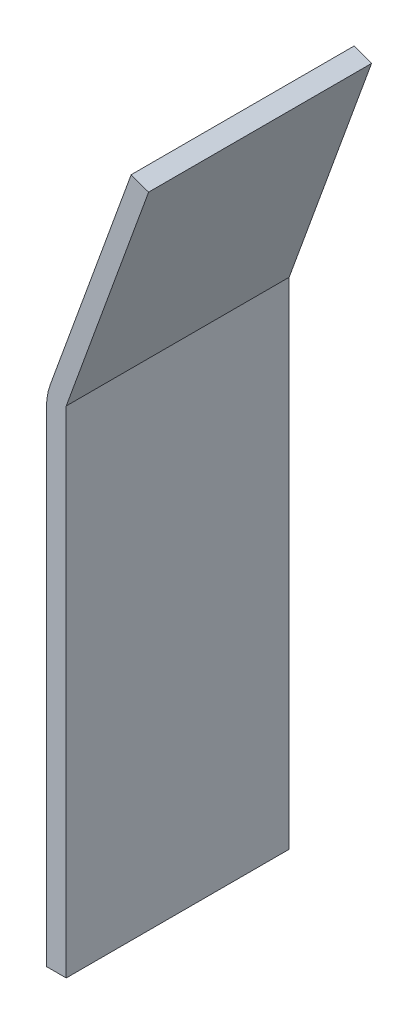
ISO-10303-21;
HEADER;
FILE_DESCRIPTION(('STEP AP214'),'2;1');
FILE_NAME('part.step','',(''),(''),'','','');
FILE_SCHEMA(('AUTOMOTIVE_DESIGN { 1 0 10303 214 1 1 1 1 }'));
ENDSEC;
DATA;
#1=APPLICATION_CONTEXT('core data for automotive mechanical design processes');
#2=APPLICATION_PROTOCOL_DEFINITION('international standard','automotive_design',2000,#1);
#3=PRODUCT_CONTEXT('',#1,'mechanical');
#4=PRODUCT('Part','Part','',(#3));
#5=PRODUCT_RELATED_PRODUCT_CATEGORY('part','',(#4));
#6=PRODUCT_DEFINITION_FORMATION('','',#4);
#7=PRODUCT_DEFINITION_CONTEXT('part definition',#1,'design');
#8=PRODUCT_DEFINITION('design','',#6,#7);
#9=PRODUCT_DEFINITION_SHAPE('','',#8);
#10=(LENGTH_UNIT() NAMED_UNIT(*) SI_UNIT(.MILLI.,.METRE.));
#11=(NAMED_UNIT(*) PLANE_ANGLE_UNIT() SI_UNIT($,.RADIAN.));
#12=(NAMED_UNIT(*) SI_UNIT($,.STERADIAN.) SOLID_ANGLE_UNIT());
#13=UNCERTAINTY_MEASURE_WITH_UNIT(LENGTH_MEASURE(1.E-05),#10,'distance_accuracy_value','');
#14=(GEOMETRIC_REPRESENTATION_CONTEXT(3) GLOBAL_UNCERTAINTY_ASSIGNED_CONTEXT((#13)) GLOBAL_UNIT_ASSIGNED_CONTEXT((#10,
#11,#12)) REPRESENTATION_CONTEXT('',''));
#15=CARTESIAN_POINT('',(0.,0.,0.));
#16=DIRECTION('',(0.,0.,1.));
#17=DIRECTION('',(1.,0.,0.));
#18=AXIS2_PLACEMENT_3D('',#15,#16,#17);
#19=CARTESIAN_POINT('',(3.19253331742775,0.,-18.));
#20=DIRECTION('',(0.,-1.,0.));
#21=DIRECTION('',(1.,0.,0.));
#22=AXIS2_PLACEMENT_3D('',#19,#20,#21);
#23=PLANE('',#22);
#24=DIRECTION('',(0.,0.,1.));
#25=VECTOR('',#24,1.);
#26=CARTESIAN_POINT('',(3.19253331742775,0.,-18.));
#27=LINE('',#26,#25);
#28=CARTESIAN_POINT('',(3.19253331742775,0.,-18.));
#29=VERTEX_POINT('',#28);
#30=CARTESIAN_POINT('',(3.19253331742775,0.,18.));
#31=VERTEX_POINT('',#30);
#32=EDGE_CURVE('E94',#29,#31,#27,.T.);
#33=ORIENTED_EDGE('',*,*,#32,.T.);
#34=DIRECTION('',(1.,0.,0.));
#35=VECTOR('',#34,1.);
#36=CARTESIAN_POINT('',(3.19253331742775,0.,18.));
#37=LINE('',#36,#35);
#38=CARTESIAN_POINT('',(0.,0.,18.));
#39=VERTEX_POINT('',#38);
#40=EDGE_CURVE('E98',#39,#31,#37,.T.);
#41=ORIENTED_EDGE('',*,*,#40,.F.);
#42=DIRECTION('',(0.,0.,1.));
#43=VECTOR('',#42,1.);
#44=CARTESIAN_POINT('',(0.,0.,-18.));
#45=LINE('',#44,#43);
#46=CARTESIAN_POINT('',(0.,0.,-18.));
#47=VERTEX_POINT('',#46);
#48=EDGE_CURVE('E139',#47,#39,#45,.T.);
#49=ORIENTED_EDGE('',*,*,#48,.F.);
#50=DIRECTION('',(1.,0.,0.));
#51=VECTOR('',#50,1.);
#52=CARTESIAN_POINT('',(3.19253331742775,0.,-18.));
#53=LINE('',#52,#51);
#54=EDGE_CURVE('E100',#47,#29,#53,.T.);
#55=ORIENTED_EDGE('',*,*,#54,.T.);
#56=EDGE_LOOP('',(#33,#41,#49,#55));
#57=FACE_BOUND('',#56,.T.);
#58=ADVANCED_FACE('F37',(#57),#23,.T.);
#59=CARTESIAN_POINT('',(0.,0.,-18.));
#60=DIRECTION('',(-1.,0.,0.));
#61=DIRECTION('',(0.,0.,1.));
#62=AXIS2_PLACEMENT_3D('',#59,#60,#61);
#63=PLANE('',#62);
#64=DIRECTION('',(0.,-1.,0.));
#65=VECTOR('',#64,1.);
#66=CARTESIAN_POINT('',(0.,0.,18.));
#67=LINE('',#66,#65);
#68=CARTESIAN_POINT('',(0.,78.2367301929154,18.));
#69=VERTEX_POINT('',#68);
#70=EDGE_CURVE('E115',#69,#39,#67,.T.);
#71=ORIENTED_EDGE('',*,*,#70,.F.);
#72=DIRECTION('',(0.,0.,1.));
#73=VECTOR('',#72,1.);
#74=CARTESIAN_POINT('',(0.,78.2367301929154,-18.));
#75=LINE('',#74,#73);
#76=CARTESIAN_POINT('',(0.,78.2367301929154,-18.));
#77=VERTEX_POINT('',#76);
#78=EDGE_CURVE('E45',#69,#77,#75,.F.);
#79=ORIENTED_EDGE('',*,*,#78,.T.);
#80=DIRECTION('',(0.,-1.,0.));
#81=VECTOR('',#80,1.);
#82=CARTESIAN_POINT('',(0.,0.,-18.));
#83=LINE('',#82,#81);
#84=EDGE_CURVE('E105',#77,#47,#83,.T.);
#85=ORIENTED_EDGE('',*,*,#84,.T.);
#86=ORIENTED_EDGE('',*,*,#48,.T.);
#87=EDGE_LOOP('',(#71,#79,#85,#86));
#88=FACE_BOUND('',#87,.T.);
#89=ADVANCED_FACE('F169',(#88),#63,.T.);
#90=CARTESIAN_POINT('',(0.,80.,-18.));
#91=DIRECTION('',(-0.939692620785909,0.342020143325666,0.));
#92=DIRECTION('',(-0.342020143325666,-0.939692620785909,0.));
#93=AXIS2_PLACEMENT_3D('',#90,#91,#92);
#94=PLANE('',#93);
#95=DIRECTION('',(-0.342020143325666,-0.939692620785909,0.));
#96=VECTOR('',#95,1.);
#97=CARTESIAN_POINT('',(0.,80.,-18.));
#98=LINE('',#97,#96);
#99=CARTESIAN_POINT('',(13.6808057330267,117.587704831436,-18.));
#100=VERTEX_POINT('',#99);
#101=CARTESIAN_POINT('',(0.603073792140909,81.656931626172,-18.));
#102=VERTEX_POINT('',#101);
#103=EDGE_CURVE('E135',#100,#102,#98,.T.);
#104=ORIENTED_EDGE('',*,*,#103,.T.);
#105=DIRECTION('',(0.,0.,1.));
#106=VECTOR('',#105,1.);
#107=CARTESIAN_POINT('',(0.603073792140909,81.656931626172,-18.));
#108=LINE('',#107,#106);
#109=CARTESIAN_POINT('',(0.603073792140909,81.656931626172,18.));
#110=VERTEX_POINT('',#109);
#111=EDGE_CURVE('E141',#102,#110,#108,.T.);
#112=ORIENTED_EDGE('',*,*,#111,.T.);
#113=DIRECTION('',(-0.342020143325666,-0.939692620785909,0.));
#114=VECTOR('',#113,1.);
#115=CARTESIAN_POINT('',(0.,80.,18.));
#116=LINE('',#115,#114);
#117=CARTESIAN_POINT('',(13.6808057330267,117.587704831436,18.));
#118=VERTEX_POINT('',#117);
#119=EDGE_CURVE('E123',#118,#110,#116,.T.);
#120=ORIENTED_EDGE('',*,*,#119,.F.);
#121=DIRECTION('',(0.,0.,1.));
#122=VECTOR('',#121,1.);
#123=CARTESIAN_POINT('',(13.6808057330267,117.587704831436,-18.));
#124=LINE('',#123,#122);
#125=EDGE_CURVE('E142',#100,#118,#124,.T.);
#126=ORIENTED_EDGE('',*,*,#125,.F.);
#127=EDGE_LOOP('',(#104,#112,#120,#126));
#128=FACE_BOUND('',#127,.T.);
#129=ADVANCED_FACE('F152',(#128),#94,.T.);
#130=CARTESIAN_POINT('',(13.6808057330267,117.587704831436,-18.));
#131=DIRECTION('',(0.342020143325668,0.939692620785909,0.));
#132=DIRECTION('',(-0.939692620785909,0.342020143325668,0.));
#133=AXIS2_PLACEMENT_3D('',#130,#131,#132);
#134=PLANE('',#133);
#135=ORIENTED_EDGE('',*,*,#125,.T.);
#136=DIRECTION('',(-0.939692620785909,0.342020143325668,0.));
#137=VECTOR('',#136,1.);
#138=CARTESIAN_POINT('',(13.6808057330267,117.587704831436,18.));
#139=LINE('',#138,#137);
#140=CARTESIAN_POINT('',(16.4998835953844,116.561644401459,18.));
#141=VERTEX_POINT('',#140);
#142=EDGE_CURVE('E120',#141,#118,#139,.T.);
#143=ORIENTED_EDGE('',*,*,#142,.F.);
#144=DIRECTION('',(0.,0.,1.));
#145=VECTOR('',#144,1.);
#146=CARTESIAN_POINT('',(16.4998835953844,116.561644401459,-18.));
#147=LINE('',#146,#145);
#148=CARTESIAN_POINT('',(16.4998835953844,116.561644401459,-18.));
#149=VERTEX_POINT('',#148);
#150=EDGE_CURVE('E144',#149,#141,#147,.T.);
#151=ORIENTED_EDGE('',*,*,#150,.F.);
#152=DIRECTION('',(-0.939692620785909,0.342020143325668,0.));
#153=VECTOR('',#152,1.);
#154=CARTESIAN_POINT('',(13.6808057330267,117.587704831436,-18.));
#155=LINE('',#154,#153);
#156=EDGE_CURVE('E132',#149,#100,#155,.T.);
#157=ORIENTED_EDGE('',*,*,#156,.T.);
#158=EDGE_LOOP('',(#135,#143,#151,#157));
#159=FACE_BOUND('',#158,.T.);
#160=ADVANCED_FACE('F158',(#159),#134,.T.);
#161=CARTESIAN_POINT('',(16.4998835953844,116.561644401459,-18.));
#162=DIRECTION('',(0.939692620785909,-0.342020143325667,0.));
#163=DIRECTION('',(0.342020143325667,0.939692620785909,0.));
#164=AXIS2_PLACEMENT_3D('',#161,#162,#163);
#165=PLANE('',#164);
#166=ORIENTED_EDGE('',*,*,#150,.T.);
#167=DIRECTION('',(0.342020143325667,0.939692620785909,0.));
#168=VECTOR('',#167,1.);
#169=CARTESIAN_POINT('',(16.4998835953844,116.561644401459,18.));
#170=LINE('',#169,#168);
#171=CARTESIAN_POINT('',(3.19253331742773,80.,18.));
#172=VERTEX_POINT('',#171);
#173=EDGE_CURVE('E112',#172,#141,#170,.T.);
#174=ORIENTED_EDGE('',*,*,#173,.F.);
#175=DIRECTION('',(0.,0.,1.));
#176=VECTOR('',#175,1.);
#177=CARTESIAN_POINT('',(3.19253331742773,80.,-18.));
#178=LINE('',#177,#176);
#179=CARTESIAN_POINT('',(3.19253331742773,80.,-18.));
#180=VERTEX_POINT('',#179);
#181=EDGE_CURVE('E104',#180,#172,#178,.T.);
#182=ORIENTED_EDGE('',*,*,#181,.F.);
#183=DIRECTION('',(0.342020143325667,0.939692620785909,0.));
#184=VECTOR('',#183,1.);
#185=CARTESIAN_POINT('',(16.4998835953844,116.561644401459,-18.));
#186=LINE('',#185,#184);
#187=EDGE_CURVE('E129',#180,#149,#186,.T.);
#188=ORIENTED_EDGE('',*,*,#187,.T.);
#189=EDGE_LOOP('',(#166,#174,#182,#188));
#190=FACE_BOUND('',#189,.T.);
#191=ADVANCED_FACE('F177',(#190),#165,.T.);
#192=CARTESIAN_POINT('',(3.19253331742773,80.,-18.));
#193=DIRECTION('',(1.,0.,0.));
#194=DIRECTION('',(0.,1.,0.));
#195=AXIS2_PLACEMENT_3D('',#192,#193,#194);
#196=PLANE('',#195);
#197=ORIENTED_EDGE('',*,*,#181,.T.);
#198=DIRECTION('',(0.,1.,0.));
#199=VECTOR('',#198,1.);
#200=CARTESIAN_POINT('',(3.19253331742773,80.,18.));
#201=LINE('',#200,#199);
#202=EDGE_CURVE('E108',#31,#172,#201,.T.);
#203=ORIENTED_EDGE('',*,*,#202,.F.);
#204=ORIENTED_EDGE('',*,*,#32,.F.);
#205=DIRECTION('',(0.,1.,0.));
#206=VECTOR('',#205,1.);
#207=CARTESIAN_POINT('',(3.19253331742773,80.,-18.));
#208=LINE('',#207,#206);
#209=EDGE_CURVE('E127',#29,#180,#208,.T.);
#210=ORIENTED_EDGE('',*,*,#209,.T.);
#211=EDGE_LOOP('',(#197,#203,#204,#210));
#212=FACE_BOUND('',#211,.T.);
#213=ADVANCED_FACE('F109',(#212),#196,.T.);
#214=CARTESIAN_POINT('',(0.,0.,-18.));
#215=DIRECTION('',(0.,0.,-1.));
#216=DIRECTION('',(-1.,0.,0.));
#217=AXIS2_PLACEMENT_3D('',#214,#215,#216);
#218=PLANE('',#217);
#219=ORIENTED_EDGE('',*,*,#84,.F.);
#220=CARTESIAN_POINT('',(10.,78.2367301929154,-18.));
#221=DIRECTION('',(0.,0.,-1.));
#222=DIRECTION('',(-1.,0.,0.));
#223=AXIS2_PLACEMENT_3D('',#220,#221,#222);
#224=CIRCLE('',#223,10.);
#225=EDGE_CURVE('E11',#77,#102,#224,.T.);
#226=ORIENTED_EDGE('',*,*,#225,.T.);
#227=ORIENTED_EDGE('',*,*,#103,.F.);
#228=ORIENTED_EDGE('',*,*,#156,.F.);
#229=ORIENTED_EDGE('',*,*,#187,.F.);
#230=ORIENTED_EDGE('',*,*,#209,.F.);
#231=ORIENTED_EDGE('',*,*,#54,.F.);
#232=EDGE_LOOP('',(#219,#226,#227,#228,#229,#230,#231));
#233=FACE_BOUND('',#232,.T.);
#234=ADVANCED_FACE('F161',(#233),#218,.T.);
#235=CARTESIAN_POINT('',(0.,0.,18.));
#236=DIRECTION('',(0.,0.,-1.));
#237=DIRECTION('',(-1.,0.,0.));
#238=AXIS2_PLACEMENT_3D('',#235,#236,#237);
#239=PLANE('',#238);
#240=ORIENTED_EDGE('',*,*,#119,.T.);
#241=CARTESIAN_POINT('',(10.,78.2367301929154,18.));
#242=DIRECTION('',(0.,0.,-1.));
#243=DIRECTION('',(-1.,0.,0.));
#244=AXIS2_PLACEMENT_3D('',#241,#242,#243);
#245=CIRCLE('',#244,10.);
#246=EDGE_CURVE('E59',#110,#69,#245,.F.);
#247=ORIENTED_EDGE('',*,*,#246,.T.);
#248=ORIENTED_EDGE('',*,*,#70,.T.);
#249=ORIENTED_EDGE('',*,*,#40,.T.);
#250=ORIENTED_EDGE('',*,*,#202,.T.);
#251=ORIENTED_EDGE('',*,*,#173,.T.);
#252=ORIENTED_EDGE('',*,*,#142,.T.);
#253=EDGE_LOOP('',(#240,#247,#248,#249,#250,#251,#252));
#254=FACE_BOUND('',#253,.T.);
#255=ADVANCED_FACE('F114',(#254),#239,.F.);
#256=CARTESIAN_POINT('',(10.,78.2367301929154,-18.));
#257=DIRECTION('',(0.,0.,1.));
#258=DIRECTION('',(1.,0.,0.));
#259=AXIS2_PLACEMENT_3D('',#256,#257,#258);
#260=CYLINDRICAL_SURFACE('',#259,10.);
#261=ORIENTED_EDGE('',*,*,#225,.F.);
#262=ORIENTED_EDGE('',*,*,#78,.F.);
#263=ORIENTED_EDGE('',*,*,#246,.F.);
#264=ORIENTED_EDGE('',*,*,#111,.F.);
#265=EDGE_LOOP('',(#261,#262,#263,#264));
#266=FACE_BOUND('',#265,.T.);
#267=ADVANCED_FACE('F39',(#266),#260,.T.);
#268=CLOSED_SHELL('',(#58,#89,#129,#160,#191,#213,#234,#255,#267));
#269=MANIFOLD_SOLID_BREP('B2',#268);
#270=ADVANCED_BREP_SHAPE_REPRESENTATION('',(#18,#269),#14);
#271=SHAPE_DEFINITION_REPRESENTATION(#9,#270);
ENDSEC;
END-ISO-10303-21;
